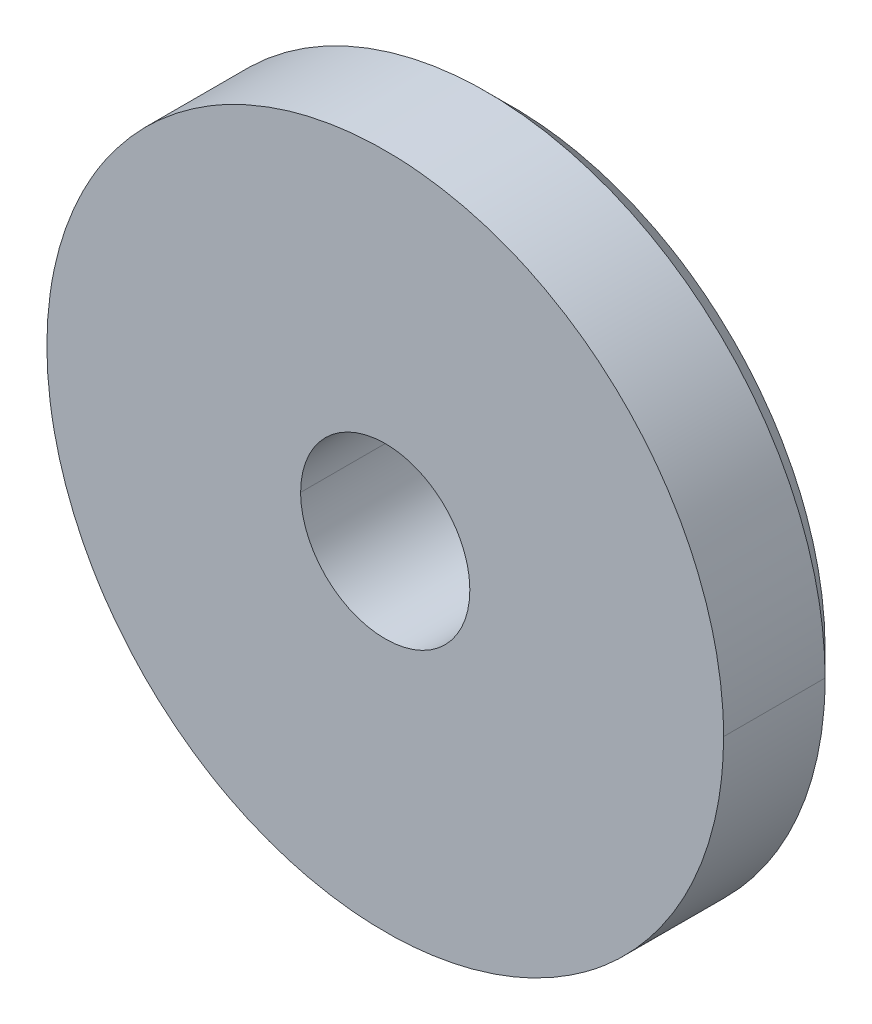
ISO-10303-21;
HEADER;
FILE_DESCRIPTION(('STEP AP214'),'2;1');
FILE_NAME('part.step','',(''),(''),'','','');
FILE_SCHEMA(('AUTOMOTIVE_DESIGN { 1 0 10303 214 1 1 1 1 }'));
ENDSEC;
DATA;
#1=APPLICATION_CONTEXT('core data for automotive mechanical design processes');
#2=APPLICATION_PROTOCOL_DEFINITION('international standard','automotive_design',2000,#1);
#3=PRODUCT_CONTEXT('',#1,'mechanical');
#4=PRODUCT('Part','Part','',(#3));
#5=PRODUCT_RELATED_PRODUCT_CATEGORY('part','',(#4));
#6=PRODUCT_DEFINITION_FORMATION('','',#4);
#7=PRODUCT_DEFINITION_CONTEXT('part definition',#1,'design');
#8=PRODUCT_DEFINITION('design','',#6,#7);
#9=PRODUCT_DEFINITION_SHAPE('','',#8);
#10=(LENGTH_UNIT() NAMED_UNIT(*) SI_UNIT(.MILLI.,.METRE.));
#11=(NAMED_UNIT(*) PLANE_ANGLE_UNIT() SI_UNIT($,.RADIAN.));
#12=(NAMED_UNIT(*) SI_UNIT($,.STERADIAN.) SOLID_ANGLE_UNIT());
#13=UNCERTAINTY_MEASURE_WITH_UNIT(LENGTH_MEASURE(1.E-05),#10,'distance_accuracy_value','');
#14=(GEOMETRIC_REPRESENTATION_CONTEXT(3) GLOBAL_UNCERTAINTY_ASSIGNED_CONTEXT((#13)) GLOBAL_UNIT_ASSIGNED_CONTEXT((#10,
#11,#12)) REPRESENTATION_CONTEXT('',''));
#15=CARTESIAN_POINT('',(0.,0.,0.));
#16=DIRECTION('',(0.,0.,1.));
#17=DIRECTION('',(1.,0.,0.));
#18=AXIS2_PLACEMENT_3D('',#15,#16,#17);
#19=CARTESIAN_POINT('',(0.976049460766,3.24671993963E-05,3.85545426228));
#20=CARTESIAN_POINT('',(0.97601299873,8.53633109443E-06,4.14825425885));
#21=CARTESIAN_POINT('',(0.976049457645,0.306651909166,3.85547932263));
#22=CARTESIAN_POINT('',(0.97601299561,0.306627978297,4.1482793192));
#23=CARTESIAN_POINT('',(0.855986811504,0.613557429072,3.8554894551));
#24=CARTESIAN_POINT('',(0.855950349468,0.613533498204,4.14828945167));
#25=CARTESIAN_POINT('',(0.613288340848,0.855969820392,3.85547904478));
#26=CARTESIAN_POINT('',(0.613251878812,0.855945889524,4.14827904135));
#27=CARTESIAN_POINT('',(4.94571779351E-05,1.09609510749,3.85542230458));
#28=CARTESIAN_POINT('',(1.29951425032E-05,1.09607117662,4.14822230115));
#29=CARTESIAN_POINT('',(-0.613189421604,0.855969820392,3.85532631296));
#30=CARTESIAN_POINT('',(-0.613225883639,0.855945889524,4.14812630953));
#31=CARTESIAN_POINT('',(-0.855887887326,0.613557429072,3.85527627738));
#32=CARTESIAN_POINT('',(-0.855924349361,0.613533498204,4.14807627395));
#33=CARTESIAN_POINT('',(-0.97595052722,0.306651909166,3.85523624239));
#34=CARTESIAN_POINT('',(-0.975986989255,0.306627978297,4.14803623896));
#35=CARTESIAN_POINT('',(-0.975950524099,3.24671993965E-05,3.85521118205));
#36=CARTESIAN_POINT('',(-0.975986986134,8.53633109443E-06,4.14801117862));
#37=B_SPLINE_SURFACE_WITH_KNOTS('',5,1,((#19,#20),(#21,#22),(#23,#24),(#25,#26),(#27,#28),(#29,
#30),(#31,#32),(#33,#34),(#35,#36)),.UNSPECIFIED.,.F.,.F.,.F.,(6,3,6),(2,2),(0.,6.28318530718,
12.5663706144),(0.300000000745,1.5),.UNSPECIFIED.);
#38=DIRECTION('',(-0.000124528808137852,-8.17311076397742E-05,0.999999988906301));
#39=VECTOR('',#38,1.);
#40=CARTESIAN_POINT('',(-0.9759687551165,2.0501765245465E-05,4.001611180335));
#41=LINE('',#40,#39);
#42=CARTESIAN_POINT('',(-0.975950524101392,3.24671994076295E-05,3.85521118190989));
#43=VERTEX_POINT('',#42);
#44=CARTESIAN_POINT('',(-0.975986986133999,8.53633109518673E-06,4.14801117861141));
#45=VERTEX_POINT('',#44);
#46=EDGE_CURVE('E75',#43,#45,#41,.T.);
#47=CARTESIAN_POINT('',(-0.975986986133999,8.53633109513173E-06,4.14801117861141));
#48=CARTESIAN_POINT('',(-0.976019665612717,0.0495793645592023,4.14801522602062));
#49=CARTESIAN_POINT('',(-0.972222562245067,0.0991368712350428,4.14801974925935));
#50=CARTESIAN_POINT('',(-0.957175118978073,0.197109302975169,4.14802963049502));
#51=CARTESIAN_POINT('',(-0.945924591985093,0.245524199326394,4.14803498851291));
#52=CARTESIAN_POINT('',(-0.914590142695726,0.345136374882293,4.14804703196816));
#53=CARTESIAN_POINT('',(-0.893692019144296,0.396079612973324,4.14805379803396));
#54=CARTESIAN_POINT('',(-0.843642589666615,0.493726562912701,4.14806801142337));
#55=CARTESIAN_POINT('',(-0.814491472814351,0.54043037185293,4.14807545873137));
#56=CARTESIAN_POINT('',(-0.748780520256903,0.628280971404677,4.14809082176505));
#57=CARTESIAN_POINT('',(-0.7122224447794,0.669429078437417,4.14809873737912));
#58=CARTESIAN_POINT('',(-0.632729152936538,0.745023029926607,4.14811481496169));
#59=CARTESIAN_POINT('',(-0.589793669897577,0.779468593974598,4.14812297694048));
#60=CARTESIAN_POINT('',(-0.498643974328852,0.840751593505803,4.14813933643117));
#61=CARTESIAN_POINT('',(-0.450416799032907,0.867569740696624,4.14814753398087));
#62=CARTESIAN_POINT('',(-0.35016093092327,0.912686027250866,4.14816370612904));
#63=CARTESIAN_POINT('',(-0.298135294254903,0.930990930629779,4.14817168089976));
#64=CARTESIAN_POINT('',(-0.204390506918451,0.955306974569725,4.14818534220389));
#65=CARTESIAN_POINT('',(-0.163149138109813,0.963203112432791,4.14819112330261));
#66=CARTESIAN_POINT('',(-0.0799972774095599,0.973631883846711,4.14820233046));
#67=CARTESIAN_POINT('',(-0.0380868790555828,0.976165260666451,4.14820775656777));
#68=CARTESIAN_POINT('',(0.0533628098058469,0.975807091191987,4.1482191154152));
#69=CARTESIAN_POINT('',(0.102901378345514,0.971843511249197,4.14822496044646));
#70=CARTESIAN_POINT('',(0.200823257052313,0.956434588356849,4.14823589515324));
#71=CARTESIAN_POINT('',(0.249205825522974,0.944984568955698,4.14824098435418));
#72=CARTESIAN_POINT('',(0.348691458110202,0.913253268081372,4.14825077974732));
#73=CARTESIAN_POINT('',(0.399539140265165,0.892164416533441,4.14825538813351));
#74=CARTESIAN_POINT('',(0.49697854873136,0.841747023963095,4.1482634014778));
#75=CARTESIAN_POINT('',(0.543569221615198,0.812416450746068,4.14826680613864));
#76=CARTESIAN_POINT('',(0.631175921764108,0.746362996796596,4.14827231707483));
#77=CARTESIAN_POINT('',(0.672192093613823,0.709640307853195,4.14827442338386));
#78=CARTESIAN_POINT('',(0.747492759530351,0.629842618355852,4.14827727853264));
#79=CARTESIAN_POINT('',(0.781777334399575,0.586767694061539,4.14827802738867));
#80=CARTESIAN_POINT('',(0.842701055133282,0.495385276179098,4.14827814536085));
#81=CARTESIAN_POINT('',(0.86932402774383,0.447067005780232,4.14827751158216));
#82=CARTESIAN_POINT('',(0.914050158275785,0.346638176173164,4.14827487311447));
#83=CARTESIAN_POINT('',(0.932155996321106,0.294528815891514,4.14827286885722));
#84=CARTESIAN_POINT('',(0.955794505363733,0.201889522377603,4.14826824102039));
#85=CARTESIAN_POINT('',(0.963371546064465,0.161868102855029,4.14826591358518));
#86=CARTESIAN_POINT('',(0.973483852526624,0.0812386429157237,4.14826058292381));
#87=CARTESIAN_POINT('',(0.97602471401665,0.0406313041273824,4.14825758045184));
#88=CARTESIAN_POINT('',(0.97601299873,8.5361493905759E-06,4.14825425884999));
#89=B_SPLINE_CURVE_WITH_KNOTS('',3,(#47,#48,#49,#50,#51,#52,#53,#54,#55,#56,#57,#58,#59,#60,#61,
#62,#63,#64,#65,#66,#67,#68,#69,#70,#71,#72,#73,#74,#75,#76,#77,#78,#79,#80,#81,#82,#83,#84,#85,
#86,#87,#88),.UNSPECIFIED.,.F.,.F.,(4,2,2,2,2,2,2,2,2,2,2,2,2,2,2,2,2,2,2,2,4),(0.,
0.148543455929664,0.297090640694499,0.461482360182372,0.625870313802274,0.79021924715013,
0.95457505474375,1.11934286479053,1.2839795375095,1.40961807688996,1.53523920185792,
1.68373884948418,1.83233134708682,1.99667717204644,2.1610635560334,2.32544567555183,
2.48982582179652,2.6545504627202,2.81922323429044,2.94111749072325,3.06287623363152),.UNSPECIFIED.);
#90=CARTESIAN_POINT('',(0.97601299873,8.53624019703715E-06,4.14825425884752));
#91=VERTEX_POINT('',#90);
#92=EDGE_CURVE('E23',#45,#91,#89,.T.);
#93=DIRECTION('',(0.000124528811552644,8.1731107639091E-05,-0.9999999889063));
#94=VECTOR('',#93,1.);
#95=CARTESIAN_POINT('',(0.976031229748,2.0501765245365E-05,4.001854260565));
#96=LINE('',#95,#94);
#97=CARTESIAN_POINT('',(0.976049460756775,3.24671994078454E-05,3.85545426214047));
#98=VERTEX_POINT('',#97);
#99=EDGE_CURVE('E65',#91,#98,#96,.T.);
#100=CARTESIAN_POINT('',(0.976049460766,3.24671994113E-05,3.8554542621));
#101=CARTESIAN_POINT('',(0.976049457645,0.306651909166,3.85547932245));
#102=CARTESIAN_POINT('',(0.855986811504,0.613557429072,3.85548945492));
#103=CARTESIAN_POINT('',(0.613288340848,0.855969820392,3.8554790446));
#104=CARTESIAN_POINT('',(4.94571779579E-05,1.09609510749,3.8554223044));
#105=CARTESIAN_POINT('',(-0.613189421604,0.855969820392,3.85532631278));
#106=CARTESIAN_POINT('',(-0.855887887326,0.613557429072,3.8552762772));
#107=CARTESIAN_POINT('',(-0.97595052722,0.306651909166,3.85523624221));
#108=CARTESIAN_POINT('',(-0.975950524099,3.24671994114E-05,3.85521118186));
#109=B_SPLINE_CURVE_WITH_KNOTS('',5,(#100,#101,#102,#103,#104,#105,#106,#107,#108),
.UNSPECIFIED.,.F.,.F.,(6,3,6),(0.,157.079632679,314.159265359),.UNSPECIFIED.);
#110=EDGE_CURVE('E74',#43,#98,#109,.F.);
#111=ORIENTED_EDGE('',*,*,#46,.T.);
#112=ORIENTED_EDGE('',*,*,#92,.T.);
#113=ORIENTED_EDGE('',*,*,#99,.T.);
#114=ORIENTED_EDGE('',*,*,#110,.F.);
#115=EDGE_LOOP('',(#111,#112,#113,#114));
#116=FACE_BOUND('',#115,.T.);
#117=ADVANCED_FACE('F16',(#116),#37,.T.);
#118=CARTESIAN_POINT('',(0.902858576842,3.84499164907E-05,3.7822451474));
#119=CARTESIAN_POINT('',(0.976049460766,3.24671994113E-05,3.8554542621));
#120=CARTESIAN_POINT('',(0.902858573956,0.283661433735,3.78226832822));
#121=CARTESIAN_POINT('',(0.976049457645,0.306651909166,3.85547932245));
#122=CARTESIAN_POINT('',(0.791800626275,0.567549039649,3.78227770076));
#123=CARTESIAN_POINT('',(0.855986811504,0.613557429072,3.85548945492));
#124=CARTESIAN_POINT('',(0.567304540918,0.79178050162,3.78226807121));
#125=CARTESIAN_POINT('',(0.613288340848,0.855969820392,3.8554790446));
#126=CARTESIAN_POINT('',(5.85735234913E-05,1.01389639218,3.78221558653));
#127=CARTESIAN_POINT('',(4.94571779579E-05,1.09609510749,3.8554223044));
#128=CARTESIAN_POINT('',(-0.56718738935,0.79178050162,3.78212679428));
#129=CARTESIAN_POINT('',(-0.613189421604,0.855969820392,3.85532631278));
#130=CARTESIAN_POINT('',(-0.791683470142,0.567549039649,3.78208051137));
#131=CARTESIAN_POINT('',(-0.855887887326,0.613557429072,3.8552762772));
#132=CARTESIAN_POINT('',(-0.902741412044,0.283661433735,3.78204347901));
#133=CARTESIAN_POINT('',(-0.97595052722,0.306651909166,3.85523624221));
#134=CARTESIAN_POINT('',(-0.902741409158,3.84499164907E-05,3.78202029818));
#135=CARTESIAN_POINT('',(-0.975950524099,3.24671994114E-05,3.85521118186));
#136=B_SPLINE_SURFACE_WITH_KNOTS('',5,1,((#118,#119),(#120,#121),(#122,#123),(#124,#125),(#126,
#127),(#128,#129),(#130,#131),(#132,#133),(#134,#135)),.UNSPECIFIED.,.F.,.F.,.F.,(6,3,6),(2,2),
(0.,157.079632679,314.159265359),(-0.212132034356,0.212132034356),.UNSPECIFIED.);
#137=DIRECTION('',(0.707018720524932,-5.77926204442466E-05,0.707194828521322));
#138=VECTOR('',#137,1.);
#139=CARTESIAN_POINT('',(0.939454018804,3.54585579508E-05,3.81884970475));
#140=LINE('',#139,#138);
#141=CARTESIAN_POINT('',(0.902858576841847,3.84499164904063E-05,3.78224514739992));
#142=VERTEX_POINT('',#141);
#143=EDGE_CURVE('E237',#142,#98,#140,.T.);
#144=CARTESIAN_POINT('',(0.902858576842,3.84499164906874E-05,3.78224514740015));
#145=CARTESIAN_POINT('',(0.90286863050016,0.0370905952116534,3.78224817696598));
#146=CARTESIAN_POINT('',(0.900583850556459,0.0741285714296735,3.78225091959933));
#147=CARTESIAN_POINT('',(0.891488724569767,0.14768768730635,3.78225579906052));
#148=CARTESIAN_POINT('',(0.884673215538957,0.184208188730611,3.78225793519324));
#149=CARTESIAN_POINT('',(0.863269651830208,0.269325419927434,3.78226222655825));
#150=CARTESIAN_POINT('',(0.84674967094521,0.317449104065496,3.78226410254838));
#151=CARTESIAN_POINT('',(0.805864602617299,0.410243067445227,3.78226659533413));
#152=CARTESIAN_POINT('',(0.781496796163969,0.454912143118321,3.7822672116928));
#153=CARTESIAN_POINT('',(0.725616191855309,0.539542428758479,3.78226716987432));
#154=CARTESIAN_POINT('',(0.694102616159167,0.579503125482643,3.78226651155838));
#155=CARTESIAN_POINT('',(0.624830346559063,0.653584786298256,3.78226393994136));
#156=CARTESIAN_POINT('',(0.587071506707105,0.687705613877616,3.78226202661095));
#157=CARTESIAN_POINT('',(0.506268534564779,0.749220681756895,3.78225699200757));
#158=CARTESIAN_POINT('',(0.463211154865413,0.77659752646651,3.78225386766315));
#159=CARTESIAN_POINT('',(0.373107936181577,0.823717750134644,3.78224649840459));
#160=CARTESIAN_POINT('',(0.326062411622011,0.843461730186202,3.78224225357872));
#161=CARTESIAN_POINT('',(0.229400589126129,0.8747157073813,3.7822327708191));
#162=CARTESIAN_POINT('',(0.179788838690346,0.886239768489403,3.7822275346011));
#163=CARTESIAN_POINT('',(0.0793323787826474,0.900790409860219,3.78221621411764));
#164=CARTESIAN_POINT('',(0.0284875779415925,0.903816358459563,3.78221012978918));
#165=CARTESIAN_POINT('',(-0.0729879847710562,0.9013106132677,3.78219728836067));
#166=CARTESIAN_POINT('',(-0.12361875959266,0.895779444891974,3.78219053130196));
#167=CARTESIAN_POINT('',(-0.223226674535677,0.876282051191716,3.78217653370315));
#168=CARTESIAN_POINT('',(-0.272203945879961,0.862316496893698,3.78216929320155));
#169=CARTESIAN_POINT('',(-0.367086452984281,0.826362447567604,3.78215453903145));
#170=CARTESIAN_POINT('',(-0.412993413194584,0.804378501644237,3.78214702552001));
#171=CARTESIAN_POINT('',(-0.500472864895845,0.753022233822015,3.7821319344032));
#172=CARTESIAN_POINT('',(-0.542045068403908,0.723649421479953,3.78212435679361));
#173=CARTESIAN_POINT('',(-0.619720282260602,0.658326386720376,3.78210934506754));
#174=CARTESIAN_POINT('',(-0.655818061803068,0.622369945147709,3.78210191109415));
#175=CARTESIAN_POINT('',(-0.72147473576176,0.544914058437219,3.78208740439112));
#176=CARTESIAN_POINT('',(-0.751033821837504,0.503414775826094,3.78208033165091));
#177=CARTESIAN_POINT('',(-0.802808064200271,0.415975800140174,3.78206673778166));
#178=CARTESIAN_POINT('',(-0.82501109429955,0.370028934881102,3.78206021757649));
#179=CARTESIAN_POINT('',(-0.861348919842518,0.275062307090688,3.7820479307425));
#180=CARTESIAN_POINT('',(-0.875489328501044,0.226044708862547,3.78204216359156));
#181=CARTESIAN_POINT('',(-0.891174530667952,0.147208425950166,3.78203376695524));
#182=CARTESIAN_POINT('',(-0.895513202240921,0.117917451831773,3.78203083268188));
#183=CARTESIAN_POINT('',(-0.901295232475644,0.0591012520361728,3.7820253055392));
#184=CARTESIAN_POINT('',(-0.902743492563976,0.0295765083028896,3.78202271209889));
#185=CARTESIAN_POINT('',(-0.902741409158,3.84499164907252E-05,3.78202029817969));
#186=B_SPLINE_CURVE_WITH_KNOTS('',3,(#144,#145,#146,#147,#148,#149,#150,#151,#152,#153,#154,
#155,#156,#157,#158,#159,#160,#161,#162,#163,#164,#165,#166,#167,#168,#169,#170,#171,#172,#173,
#174,#175,#176,#177,#178,#179,#180,#181,#182,#183,#184,#185),.UNSPECIFIED.,.F.,.F.,(4,2,2,2,2,2,
2,2,2,2,2,2,2,2,2,2,2,2,2,2,4),(0.,0.111058284074246,0.222243341947195,0.374128236228977,
0.526065810286498,0.678019931201982,0.829977603693962,0.982323228966974,1.13465685447813,
1.28672921373093,1.4388128761992,1.59088720095017,1.74294942849989,1.89492551985478,
2.04691170143374,2.19904220287271,2.35116824453335,2.50354382689183,2.65581319509513,
2.7445158256684,2.83306791016801),.UNSPECIFIED.);
#187=CARTESIAN_POINT('',(-0.902741409157654,3.84499164908437E-05,3.78202029818008));
#188=VERTEX_POINT('',#187);
#189=EDGE_CURVE('E153',#142,#188,#186,.T.);
#190=DIRECTION('',(0.707194830868391,5.77926204440462E-05,-0.707018718177277));
#191=VECTOR('',#190,1.);
#192=CARTESIAN_POINT('',(-0.939345966628,3.545855795145E-05,3.81861574002));
#193=LINE('',#192,#191);
#194=EDGE_CURVE('E235',#43,#188,#193,.T.);
#195=ORIENTED_EDGE('',*,*,#143,.F.);
#196=ORIENTED_EDGE('',*,*,#189,.T.);
#197=ORIENTED_EDGE('',*,*,#194,.F.);
#198=ORIENTED_EDGE('',*,*,#110,.T.);
#199=EDGE_LOOP('',(#195,#196,#197,#198));
#200=FACE_BOUND('',#199,.T.);
#201=ADVANCED_FACE('F162',(#200),#136,.T.);
#202=CARTESIAN_POINT('',(-0.902741409157,3.8449916491E-05,3.78202029818));
#203=CARTESIAN_POINT('',(-0.975950524099,3.24671994119E-05,3.85521118186));
#204=CARTESIAN_POINT('',(-0.902741406271,-0.283584533902,3.78199711736));
#205=CARTESIAN_POINT('',(-0.975950520978,-0.306586974767,3.85518612152));
#206=CARTESIAN_POINT('',(-0.79168345859,-0.567472139816,3.78198774483));
#207=CARTESIAN_POINT('',(-0.855887874837,-0.613492494674,3.85517598905));
#208=CARTESIAN_POINT('',(-0.567187373233,-0.791703601786,3.78199737437));
#209=CARTESIAN_POINT('',(-0.613189404181,-0.855904885993,3.85518639937));
#210=CARTESIAN_POINT('',(5.85941613329E-05,-1.01381949235,3.78204985906));
#211=CARTESIAN_POINT('',(4.94794891379E-05,-1.09603017309,3.85524313957));
#212=CARTESIAN_POINT('',(0.567304557034,-0.791703601786,3.78213865131));
#213=CARTESIAN_POINT('',(0.613288358271,-0.855904885993,3.85533913118));
#214=CARTESIAN_POINT('',(0.791800637827,-0.567472139816,3.78218493422));
#215=CARTESIAN_POINT('',(0.855986823993,-0.613492494674,3.85538916677));
#216=CARTESIAN_POINT('',(0.902858579729,-0.283584533902,3.78222196658));
#217=CARTESIAN_POINT('',(0.976049463887,-0.306586974767,3.85542920175));
#218=CARTESIAN_POINT('',(0.902858576842,3.84499164904E-05,3.7822451474));
#219=CARTESIAN_POINT('',(0.976049460766,3.24671994112E-05,3.8554542621));
#220=B_SPLINE_SURFACE_WITH_KNOTS('',5,1,((#202,#203),(#204,#205),(#206,#207),(#208,#209),(#210,
#211),(#212,#213),(#214,#215),(#216,#217),(#218,#219)),.UNSPECIFIED.,.F.,.F.,.F.,(6,3,6),(2,2),
(314.159265359,471.238898038,628.318530718),(-0.212132034358,0.212132034358),.UNSPECIFIED.);
#221=CARTESIAN_POINT('',(-0.902741409157,3.84499164910126E-05,3.78202029817985));
#222=CARTESIAN_POINT('',(-0.902751462814431,-0.0370136953779133,3.78201726861447));
#223=CARTESIAN_POINT('',(-0.900466682871218,-0.0740516715954581,3.78201452598095));
#224=CARTESIAN_POINT('',(-0.891371556886057,-0.147610787471198,3.7820096465192));
#225=CARTESIAN_POINT('',(-0.884556047856302,-0.184131288895,3.78200751038606));
#226=CARTESIAN_POINT('',(-0.86315248414819,-0.26924852009144,3.78200321902092));
#227=CARTESIAN_POINT('',(-0.846632503262009,-0.317372204229388,3.7820013430314));
#228=CARTESIAN_POINT('',(-0.805747434933276,-0.41016616760947,3.78199885024609));
#229=CARTESIAN_POINT('',(-0.781379628480294,-0.454835243283025,3.78199823388726));
#230=CARTESIAN_POINT('',(-0.725499024171876,-0.539465528923882,3.78199827570562));
#231=CARTESIAN_POINT('',(-0.693985448475642,-0.579426225648295,3.78199893402161));
#232=CARTESIAN_POINT('',(-0.624713178875413,-0.653507886464492,3.78200150563866));
#233=CARTESIAN_POINT('',(-0.586954339023419,-0.687628714044183,3.78200341896905));
#234=CARTESIAN_POINT('',(-0.506151366880872,-0.749143781924183,3.78200845357242));
#235=CARTESIAN_POINT('',(-0.463093987181313,-0.776520626634176,3.78201157791685));
#236=CARTESIAN_POINT('',(-0.372990768497,-0.823640850303029,3.78201894717542));
#237=CARTESIAN_POINT('',(-0.325945243937147,-0.843384830354924,3.78202319200128));
#238=CARTESIAN_POINT('',(-0.229283421440763,-0.874638807550466,3.7820326747609));
#239=CARTESIAN_POINT('',(-0.179671671004773,-0.886162868658705,3.7820379109789));
#240=CARTESIAN_POINT('',(-0.0792152110966512,-0.900713510029421,3.78204923146236));
#241=CARTESIAN_POINT('',(-0.0283704102553806,-0.903739458628538,3.78205531579082));
#242=CARTESIAN_POINT('',(0.0731051524556471,-0.901233713435733,3.78206815721932));
#243=CARTESIAN_POINT('',(0.123735927275422,-0.895702545059617,3.78207491427803));
#244=CARTESIAN_POINT('',(0.223343842214881,-0.876205151359299,3.78208891187685));
#245=CARTESIAN_POINT('',(0.272321113557433,-0.862239597061601,3.78209615237845));
#246=CARTESIAN_POINT('',(0.367203620660395,-0.826285547736364,3.78211090654855));
#247=CARTESIAN_POINT('',(0.41311058087096,-0.804301601813239,3.78211842005999));
#248=CARTESIAN_POINT('',(0.500590032572999,-0.752945333991789,3.7821335111768));
#249=CARTESIAN_POINT('',(0.542162236081578,-0.72357252165026,3.78214108878639));
#250=CARTESIAN_POINT('',(0.61983744994126,-0.658249486890427,3.78215610051244));
#251=CARTESIAN_POINT('',(0.655935229485957,-0.622293045316687,3.78216353448581));
#252=CARTESIAN_POINT('',(0.721591903448685,-0.54483715860354,3.78217804118892));
#253=CARTESIAN_POINT('',(0.751150989526241,-0.503337875990837,3.78218511392926));
#254=CARTESIAN_POINT('',(0.802925231890584,-0.415898900302694,3.78219870779818));
#255=CARTESIAN_POINT('',(0.825128261989889,-0.369952035043132,3.7822052280029));
#256=CARTESIAN_POINT('',(0.861466087533238,-0.274985407251814,3.7822175148381));
#257=CARTESIAN_POINT('',(0.875606496192129,-0.225967809023262,3.7822232819907));
#258=CARTESIAN_POINT('',(0.891291698356829,-0.147131526111387,3.78223167862635));
#259=CARTESIAN_POINT('',(0.89563036992841,-0.117840551994076,3.78223461289876));
#260=CARTESIAN_POINT('',(0.901412400160784,-0.0590243522007128,3.78224014004016));
#261=CARTESIAN_POINT('',(0.902860660248148,-0.0294996084685846,3.78224273348013));
#262=CARTESIAN_POINT('',(0.902858576842,3.84499164903749E-05,3.78224514740031));
#263=B_SPLINE_CURVE_WITH_KNOTS('',3,(#221,#222,#223,#224,#225,#226,#227,#228,#229,#230,#231,
#232,#233,#234,#235,#236,#237,#238,#239,#240,#241,#242,#243,#244,#245,#246,#247,#248,#249,#250,
#251,#252,#253,#254,#255,#256,#257,#258,#259,#260,#261,#262),.UNSPECIFIED.,.F.,.F.,(4,2,2,2,2,2,
2,2,2,2,2,2,2,2,2,2,2,2,2,2,4),(0.,0.111058284072565,0.222243341943533,0.374128236225998,
0.526065810284442,0.678019931200578,0.829977603693347,0.982323228967439,1.13465685447976,
1.28672921373323,1.43881287620201,1.59088720094769,1.74294942849229,1.89492551984763,
2.04691170142699,2.19904220287293,2.3511682445404,2.5035438269003,2.65581319510482,
2.74451582567424,2.83306791017018),.UNSPECIFIED.);
#264=EDGE_CURVE('E158',#188,#142,#263,.T.);
#265=CARTESIAN_POINT('',(-0.975950524099,3.24671994115E-05,3.85521118186));
#266=CARTESIAN_POINT('',(-0.975950520978,-0.306586974767,3.85518612152));
#267=CARTESIAN_POINT('',(-0.855887874837,-0.613492494674,3.85517598905));
#268=CARTESIAN_POINT('',(-0.613189404181,-0.855904885993,3.85518639937));
#269=CARTESIAN_POINT('',(4.94794891412E-05,-1.09603017309,3.85524313957));
#270=CARTESIAN_POINT('',(0.613288358271,-0.855904885993,3.85533913118));
#271=CARTESIAN_POINT('',(0.855986823993,-0.613492494674,3.85538916677));
#272=CARTESIAN_POINT('',(0.976049463887,-0.306586974767,3.85542920175));
#273=CARTESIAN_POINT('',(0.976049460766,3.24671994111E-05,3.8554542621));
#274=B_SPLINE_CURVE_WITH_KNOTS('',5,(#265,#266,#267,#268,#269,#270,#271,#272,#273),
.UNSPECIFIED.,.F.,.F.,(6,3,6),(12.5663706144,18.8495559215,25.1327412287),.UNSPECIFIED.);
#275=EDGE_CURVE('E152',#43,#98,#274,.T.);
#276=ORIENTED_EDGE('',*,*,#194,.T.);
#277=ORIENTED_EDGE('',*,*,#264,.T.);
#278=ORIENTED_EDGE('',*,*,#143,.T.);
#279=ORIENTED_EDGE('',*,*,#275,.F.);
#280=EDGE_LOOP('',(#276,#277,#278,#279));
#281=FACE_BOUND('',#280,.T.);
#282=ADVANCED_FACE('F125',(#281),#220,.T.);
#283=CARTESIAN_POINT('',(5.85838424126E-05,3.84499164906E-05,3.78213272279));
#284=DIRECTION('',(-0.000124528809611037,-8.17311076401246E-05,0.999999988906301));
#285=DIRECTION('',(0.999999992246288,0.,0.000124528810026962));
#286=AXIS2_PLACEMENT_3D('',#283,#284,#285);
#287=PLANE('',#286);
#288=CARTESIAN_POINT('',(-0.243941414266,3.84499164906145E-05,3.78210233775982));
#289=CARTESIAN_POINT('',(-0.243953434449117,-0.0136805998741809,3.78210121499015));
#290=CARTESIAN_POINT('',(-0.242787955785832,-0.0273958590447934,3.78210023916263));
#291=CARTESIAN_POINT('',(-0.238182131138082,-0.0544273697025755,3.78209860340527));
#292=CARTESIAN_POINT('',(-0.234743707180429,-0.0677439483818637,3.78209794320934));
#293=CARTESIAN_POINT('',(-0.225669499099059,-0.0936179069665731,3.78209695850234));
#294=CARTESIAN_POINT('',(-0.220032563958268,-0.106174885203539,3.78209663416742));
#295=CARTESIAN_POINT('',(-0.206747041189865,-0.130155219309278,3.78209632865851));
#296=CARTESIAN_POINT('',(-0.199098764331948,-0.141578749930291,3.78209634743152));
#297=CARTESIAN_POINT('',(-0.173420995358586,-0.173661495166728,3.78209692289516));
#298=CARTESIAN_POINT('',(-0.152628372362356,-0.192216846379674,3.78209799562615));
#299=CARTESIAN_POINT('',(-0.106071235870219,-0.221386948917574,3.78210140922669));
#300=CARTESIAN_POINT('',(-0.080298025295365,-0.231987649399349,3.78210375232765));
#301=CARTESIAN_POINT('',(-0.0267526834854187,-0.244032427797408,3.78210943583042));
#302=CARTESIAN_POINT('',(0.00101429315272359,-0.24549931481173,3.78211277372611));
#303=CARTESIAN_POINT('',(0.0555103522239511,-0.239158175297444,3.78212007832221));
#304=CARTESIAN_POINT('',(0.0822378870168942,-0.231336827251303,3.78212404591867));
#305=CARTESIAN_POINT('',(0.131539385055629,-0.207315621273826,3.78213214865787));
#306=CARTESIAN_POINT('',(0.15412078858929,-0.191130974554591,3.78213628348391));
#307=CARTESIAN_POINT('',(0.192736283168432,-0.152115379245067,3.78214428101396));
#308=CARTESIAN_POINT('',(0.208755322502512,-0.129269354844517,3.78214814307576));
#309=CARTESIAN_POINT('',(0.226421278617509,-0.0920980307470904,3.7821533810509));
#310=CARTESIAN_POINT('',(0.231252919302829,-0.0791935808651548,3.78215503742517));
#311=CARTESIAN_POINT('',(0.238674990816741,-0.0527595073409256,3.7821581221707));
#312=CARTESIAN_POINT('',(0.241268801445729,-0.0392308591002468,3.78215955088312));
#313=CARTESIAN_POINT('',(0.243611984988157,-0.0170737069467953,3.78216165360562));
#314=CARTESIAN_POINT('',(0.244063995040805,-0.00851437973974919,3.78216240945845));
#315=CARTESIAN_POINT('',(0.244058581951,3.84499164904711E-05,3.78216310782035));
#316=B_SPLINE_CURVE_WITH_KNOTS('',3,(#288,#289,#290,#291,#292,#293,#294,#295,#296,#297,#298,
#299,#300,#301,#302,#303,#304,#305,#306,#307,#308,#309,#310,#311,#312,#313,#314,#315),
.UNSPECIFIED.,.F.,.F.,(4,2,2,2,2,2,2,2,2,2,2,2,2,4),(0.,0.0411014434350411,0.0821681754345153,
0.123256436593653,0.164338352987133,0.246247380886622,0.328300751915893,0.410149135568275,
0.492115051001766,0.573932408394778,0.655936388737336,0.697112382827344,0.738226079296645,
0.763888788667658),.UNSPECIFIED.);
#317=CARTESIAN_POINT('',(-0.243941414266,3.84499164906428E-05,3.78210233776009));
#318=VERTEX_POINT('',#317);
#319=CARTESIAN_POINT('',(0.244058581951,3.84499164905356E-05,3.78216310782018));
#320=VERTEX_POINT('',#319);
#321=EDGE_CURVE('E114',#318,#320,#316,.T.);
#322=ORIENTED_EDGE('',*,*,#321,.T.);
#323=CARTESIAN_POINT('',(0.244058581951,3.84499164905856E-05,3.78216310782018));
#324=CARTESIAN_POINT('',(0.244071728094655,0.0137567361173647,3.78216423066765));
#325=CARTESIAN_POINT('',(0.242905700806418,0.0274722486648608,3.78216520644757));
#326=CARTESIAN_POINT('',(0.238298779446531,0.0545044413007847,3.78216684212409));
#327=CARTESIAN_POINT('',(0.234859779046536,0.0678214437525683,3.78216750228287));
#328=CARTESIAN_POINT('',(0.225787680896176,0.0936944456101512,3.78216848717442));
#329=CARTESIAN_POINT('',(0.220153394095547,0.10625002833587,3.78216881172507));
#330=CARTESIAN_POINT('',(0.206859896790212,0.130235048770541,3.78216911662396));
#331=CARTESIAN_POINT('',(0.199201097886578,0.141664714740614,3.78216909704212));
#332=CARTESIAN_POINT('',(0.182072880465822,0.16308428004158,3.78216871473038));
#333=CARTESIAN_POINT('',(0.172602637133113,0.173073519846686,3.78216835184388));
#334=CARTESIAN_POINT('',(0.152122742353557,0.191324496891383,3.78216729317952));
#335=CARTESIAN_POINT('',(0.141113060140236,0.199586199597026,3.78216659739501));
#336=CARTESIAN_POINT('',(0.117834161932205,0.214163065829941,3.78216488988493));
#337=CARTESIAN_POINT('',(0.1055620065758,0.220473543158801,3.78216387741032));
#338=CARTESIAN_POINT('',(0.0801510830515565,0.230931318557557,3.78216156774381));
#339=CARTESIAN_POINT('',(0.0670133685885127,0.235081193999833,3.78216027089377));
#340=CARTESIAN_POINT('',(0.0360578685082309,0.242039951167835,3.78215698478908));
#341=CARTESIAN_POINT('',(0.0180496022615604,0.244036802931723,3.78215490544601));
#342=CARTESIAN_POINT('',(-0.0136529931366819,0.244039703704363,3.78215095779658));
#343=CARTESIAN_POINT('',(-0.0273545516692008,0.242882044990244,3.78214915694106));
#344=CARTESIAN_POINT('',(-0.0543781537211301,0.238290075339778,3.78214541641725));
#345=CARTESIAN_POINT('',(-0.0676997935491953,0.23485343041494,3.78214347660847));
#346=CARTESIAN_POINT('',(-0.106468587808301,0.221240447860893,3.78213753617252));
#347=CARTESIAN_POINT('',(-0.130836195829151,0.207760206562372,3.78213339994838));
#348=CARTESIAN_POINT('',(-0.173725450155456,0.173465815772746,3.78212525608153));
#349=CARTESIAN_POINT('',(-0.192244036210102,0.152647839137633,3.78212124850712));
#350=CARTESIAN_POINT('',(-0.214083099284536,0.117798777041148,3.7821156806633));
#351=CARTESIAN_POINT('',(-0.220381850216002,0.10554085402772,3.78211389443446));
#352=CARTESIAN_POINT('',(-0.230832776355746,0.0801300446009904,3.7821105161371));
#353=CARTESIAN_POINT('',(-0.234986060232404,0.0669776244029049,3.78210892396863));
#354=CARTESIAN_POINT('',(-0.239976632848971,0.0447933445101313,3.78210648935377));
#355=CARTESIAN_POINT('',(-0.241463200136577,0.0359010542726193,3.78210557745856));
#356=CARTESIAN_POINT('',(-0.243445313553273,0.0180200239276603,3.78210386919442));
#357=CARTESIAN_POINT('',(-0.243942326036209,0.00903144640447489,3.78210307265617));
#358=CARTESIAN_POINT('',(-0.243941414266,3.84499164907289E-05,3.78210233775965));
#359=B_SPLINE_CURVE_WITH_KNOTS('',3,(#323,#324,#325,#326,#327,#328,#329,#330,#331,#332,#333,
#334,#335,#336,#337,#338,#339,#340,#341,#342,#343,#344,#345,#346,#347,#348,#349,#350,#351,#352,
#353,#354,#355,#356,#357,#358),.UNSPECIFIED.,.F.,.F.,(4,2,2,2,2,2,2,2,2,2,2,2,2,2,2,2,2,4),(0.,
0.0411011873932817,0.0821681754334133,0.12325743790051,0.164338352976624,0.205438018387513,
0.246538505313664,0.287736948771565,0.328886133532547,0.382765462612746,0.423828760810554,
0.464934178431976,0.546812465179672,0.628733520548647,0.669916141237457,0.71107745949787,
0.738073961917008,0.765030430196088),.UNSPECIFIED.);
#360=EDGE_CURVE('E146',#320,#318,#359,.T.);
#361=ORIENTED_EDGE('',*,*,#360,.T.);
#362=EDGE_LOOP('',(#322,#361));
#363=FACE_BOUND('',#362,.T.);
#364=ORIENTED_EDGE('',*,*,#264,.F.);
#365=ORIENTED_EDGE('',*,*,#189,.F.);
#366=EDGE_LOOP('',(#364,#365));
#367=FACE_BOUND('',#366,.T.);
#368=ADVANCED_FACE('F104',(#363,#367),#287,.F.);
#369=CARTESIAN_POINT('',(-0.975950524099,3.24671994115E-05,3.85521118186));
#370=CARTESIAN_POINT('',(-0.975986986134,8.53633109454E-06,4.14801117862));
#371=CARTESIAN_POINT('',(-0.975950520978,-0.306586974767,3.85518612152));
#372=CARTESIAN_POINT('',(-0.975986983014,-0.306610905635,4.14798611827));
#373=CARTESIAN_POINT('',(-0.855887874837,-0.613492494674,3.85517598905));
#374=CARTESIAN_POINT('',(-0.855924336872,-0.613516425542,4.1479759858));
#375=CARTESIAN_POINT('',(-0.613189404181,-0.855904885993,3.85518639937));
#376=CARTESIAN_POINT('',(-0.613225866216,-0.855928816861,4.14798639612));
#377=CARTESIAN_POINT('',(4.94794891412E-05,-1.09603017309,3.85524313957));
#378=CARTESIAN_POINT('',(1.30174536863E-05,-1.09605410396,4.14804313632));
#379=CARTESIAN_POINT('',(0.613288358271,-0.855904885993,3.85533913118));
#380=CARTESIAN_POINT('',(0.613251896236,-0.855928816861,4.14813912794));
#381=CARTESIAN_POINT('',(0.855986823993,-0.613492494674,3.85538916677));
#382=CARTESIAN_POINT('',(0.855950361957,-0.613516425542,4.14818916352));
#383=CARTESIAN_POINT('',(0.976049463887,-0.306586974767,3.85542920175));
#384=CARTESIAN_POINT('',(0.976013001851,-0.306610905635,4.14822919851));
#385=CARTESIAN_POINT('',(0.976049460766,3.24671994111E-05,3.8554542621));
#386=CARTESIAN_POINT('',(0.97601299873,8.5363310941E-06,4.14825425885));
#387=B_SPLINE_SURFACE_WITH_KNOTS('',5,1,((#369,#370),(#371,#372),(#373,#374),(#375,#376),(#377,
#378),(#379,#380),(#381,#382),(#383,#384),(#385,#386)),.UNSPECIFIED.,.F.,.F.,.F.,(6,3,6),(2,2),
(12.5663706144,18.8495559215,25.1327412287),(0.3,1.5),.UNSPECIFIED.);
#388=CARTESIAN_POINT('',(-0.975986986133999,8.53633109524173E-06,4.14801117861141));
#389=CARTESIAN_POINT('',(-0.976019660488125,-0.0495625081759819,4.14800712304609));
#390=CARTESIAN_POINT('',(-0.972222524991561,-0.0991202310615606,4.14800354549123));
#391=CARTESIAN_POINT('',(-0.957175019048539,-0.197092653229047,4.14799741194459));
#392=CARTESIAN_POINT('',(-0.945924526371992,-0.245507333752338,4.14799485596956));
#393=CARTESIAN_POINT('',(-0.91459038371998,-0.345118497745502,4.14799061664223));
#394=CARTESIAN_POINT('',(-0.893692635812285,-0.396060972574134,4.14798905542899));
#395=CARTESIAN_POINT('',(-0.843643496896576,-0.493708049491014,4.1479873071849));
#396=CARTESIAN_POINT('',(-0.81449204153534,-0.540412618533043,4.14798712016478));
#397=CARTESIAN_POINT('',(-0.748779854189154,-0.628264677763678,4.14798812297915));
#398=CARTESIAN_POINT('',(-0.712220865969963,-0.669413472014231,4.14798931248991));
#399=CARTESIAN_POINT('',(-0.63272789640769,-0.745007159913005,4.14799303329898));
#400=CARTESIAN_POINT('',(-0.589793872677632,-0.779452008983844,4.14799556460621));
#401=CARTESIAN_POINT('',(-0.498659195988743,-0.840723639255947,4.14800190570087));
#402=CARTESIAN_POINT('',(-0.450447331028813,-0.867533749087587,4.14800571824709));
#403=CARTESIAN_POINT('',(-0.350202087304431,-0.912655589128227,4.1480145138101));
#404=CARTESIAN_POINT('',(-0.298169026977317,-0.930968026557632,4.14801949672942));
#405=CARTESIAN_POINT('',(-0.191885053394345,-0.958530714346252,4.14803047941725));
#406=CARTESIAN_POINT('',(-0.13763953734166,-0.96780178716157,4.14803647681181));
#407=CARTESIAN_POINT('',(-0.0283599514730378,-0.977121494857423,4.14804932355866));
#408=CARTESIAN_POINT('',(0.0266741669087274,-0.977169559279501,4.14805617296363));
#409=CARTESIAN_POINT('',(0.136029559638037,-0.968036166449024,4.14807053734298));
#410=CARTESIAN_POINT('',(0.190350045397541,-0.95884524773841,4.14807805299246));
#411=CARTESIAN_POINT('',(0.296666607415292,-0.931452247984042,4.14809353132776));
#412=CARTESIAN_POINT('',(0.348662825658802,-0.913250718204538,4.1481014939862));
#413=CARTESIAN_POINT('',(0.448776735423533,-0.86840327073388,4.14811762648394));
#414=CARTESIAN_POINT('',(0.496900338285263,-0.841770541708676,4.14812579598145));
#415=CARTESIAN_POINT('',(0.588007581545415,-0.780817488551308,4.14814212321873));
#416=CARTESIAN_POINT('',(0.630991058197025,-0.746496919610915,4.14815028095812));
#417=CARTESIAN_POINT('',(0.710683392341194,-0.671079495638577,4.1481663688994));
#418=CARTESIAN_POINT('',(0.747379822529934,-0.629969528121472,4.14817429862544));
#419=CARTESIAN_POINT('',(0.81336336259308,-0.542150178408898,4.14818969305002));
#420=CARTESIAN_POINT('',(0.842650803611041,-0.495441046604734,4.14819715776935));
#421=CARTESIAN_POINT('',(0.880383306407375,-0.422199476735546,4.14820784266777));
#422=CARTESIAN_POINT('',(0.891937581425099,-0.397224859330456,4.14821132271106));
#423=CARTESIAN_POINT('',(0.912888339159409,-0.346414097654271,4.14821808450388));
#424=CARTESIAN_POINT('',(0.922286613760375,-0.320578689403927,4.14822136641638));
#425=CARTESIAN_POINT('',(0.947132397081092,-0.242047538471485,4.14823087887033));
#426=CARTESIAN_POINT('',(0.959273319875981,-0.188244323112008,4.14823678816165));
#427=CARTESIAN_POINT('',(0.969873146656306,-0.111683866782654,4.14824436551608));
#428=CARTESIAN_POINT('',(0.972177198655963,-0.0893869030802669,4.14824647479231));
#429=CARTESIAN_POINT('',(0.975244839409149,-0.0447281662208998,4.14825050681061));
#430=CARTESIAN_POINT('',(0.976011239987254,-0.0223665863826303,4.14825242988703));
#431=CARTESIAN_POINT('',(0.97601299873,8.53614929912524E-06,4.14825425885139));
#432=B_SPLINE_CURVE_WITH_KNOTS('',3,(#388,#389,#390,#391,#392,#393,#394,#395,#396,#397,#398,
#399,#400,#401,#402,#403,#404,#405,#406,#407,#408,#409,#410,#411,#412,#413,#414,#415,#416,#417,
#418,#419,#420,#421,#422,#423,#424,#425,#426,#427,#428,#429,#430,#431),.UNSPECIFIED.,.F.,.F.,(4,
2,2,2,2,2,2,2,2,2,2,2,2,2,2,2,2,2,2,2,2,4),(0.,0.148544102407165,0.297090640898874,
0.461479836582212,0.62587031402477,0.7902221380935,0.954575054970043,1.11928415143415,
1.28397953749271,1.44829472448401,1.61262007464048,1.77711387871724,1.94159762039664,
2.10582532611577,2.2700582621741,2.43461217521103,2.59915873223789,2.68162537970039,
2.7640232375523,2.92854385244896,2.99575194109686,3.06283701732068),.UNSPECIFIED.);
#433=EDGE_CURVE('E71',#45,#91,#432,.T.);
#434=ORIENTED_EDGE('',*,*,#99,.F.);
#435=ORIENTED_EDGE('',*,*,#433,.F.);
#436=ORIENTED_EDGE('',*,*,#46,.F.);
#437=ORIENTED_EDGE('',*,*,#275,.T.);
#438=EDGE_LOOP('',(#434,#435,#436,#437));
#439=FACE_BOUND('',#438,.T.);
#440=ADVANCED_FACE('F77',(#439),#387,.T.);
#441=CARTESIAN_POINT('',(0.244058581951,3.84499164906E-05,3.78216310782));
#442=CARTESIAN_POINT('',(0.244013004406,8.53633109432E-06,4.14816310376));
#443=CARTESIAN_POINT('',(0.24405858117,0.0766933104081,3.78216937291));
#444=CARTESIAN_POINT('',(0.244013003626,0.0766633968227,4.14816936885));
#445=CARTESIAN_POINT('',(0.214042919635,0.153419690385,3.78217190603));
#446=CARTESIAN_POINT('',(0.213997342091,0.153389776799,4.14817190197));
#447=CARTESIAN_POINT('',(0.153368301971,0.214022788215,3.78216930345));
#448=CARTESIAN_POINT('',(0.153322724427,0.213992874629,4.14816929939));
#449=CARTESIAN_POINT('',(5.85810535148E-05,0.274054109988,3.7821551184));
#450=CARTESIAN_POINT('',(1.30035091972E-05,0.274024196403,4.14815511434));
#451=CARTESIAN_POINT('',(-0.153251138642,0.214022788215,3.78213112049));
#452=CARTESIAN_POINT('',(-0.153296716186,0.213992874629,4.14813111643));
#453=CARTESIAN_POINT('',(-0.213925755072,0.153419690385,3.7821186116));
#454=CARTESIAN_POINT('',(-0.213971332617,0.153389776799,4.14811860754));
#455=CARTESIAN_POINT('',(-0.243941415046,0.0766933104081,3.78210860285));
#456=CARTESIAN_POINT('',(-0.24398699259,0.0766633968227,4.14810859879));
#457=CARTESIAN_POINT('',(-0.243941414266,3.84499164907E-05,3.78210233776));
#458=CARTESIAN_POINT('',(-0.24398699181,8.53633109438E-06,4.1481023337));
#459=B_SPLINE_SURFACE_WITH_KNOTS('',5,1,((#441,#442),(#443,#444),(#445,#446),(#447,#448),(#449,
#450),(#451,#452),(#453,#454),(#455,#456),(#457,#458)),.UNSPECIFIED.,.F.,.F.,.F.,(6,3,6),(2,2),
(0.,1.57079632679,3.14159265359),(0.,1.5),.UNSPECIFIED.);
#460=DIRECTION('',(-0.000124528811475313,-8.17311076399889E-05,0.9999999889063));
#461=VECTOR('',#460,1.);
#462=CARTESIAN_POINT('',(0.2440357931785,2.349312379237E-05,3.96516310579));
#463=LINE('',#462,#461);
#464=CARTESIAN_POINT('',(0.244013004406,8.53633109424724E-06,4.14816310375991));
#465=VERTEX_POINT('',#464);
#466=EDGE_CURVE('E79',#320,#465,#463,.T.);
#467=CARTESIAN_POINT('',(-0.24398699181,8.53633109439447E-06,4.14810233369982));
#468=CARTESIAN_POINT('',(-0.244000138233019,0.0137268225316946,4.14810345327379));
#469=CARTESIAN_POINT('',(-0.242834111224108,0.0274423350789275,4.14810471946194));
#470=CARTESIAN_POINT('',(-0.238227190414795,0.0544745277143102,4.14810750252748));
#471=CARTESIAN_POINT('',(-0.234788190286061,0.067791530165817,4.14810901919541));
#472=CARTESIAN_POINT('',(-0.225716092662778,0.0936645320228623,4.14811226356203));
#473=CARTESIAN_POINT('',(-0.220081806117959,0.106220114748321,4.14811399137475));
#474=CARTESIAN_POINT('',(-0.206788309301354,0.130205135182588,4.14811760712041));
#475=CARTESIAN_POINT('',(-0.199129510630634,0.141634801152511,4.14811949502077));
#476=CARTESIAN_POINT('',(-0.182001293646402,0.16305436645328,4.14812337862208));
#477=CARTESIAN_POINT('',(-0.172531050517285,0.173043606258334,4.14812537437184));
#478=CARTESIAN_POINT('',(-0.152051156109833,0.191294583303062,4.14812941638133));
#479=CARTESIAN_POINT('',(-0.141041474065019,0.19955628600878,4.14813146264207));
#480=CARTESIAN_POINT('',(-0.117762576154372,0.214133152241733,4.14813555291898));
#481=CARTESIAN_POINT('',(-0.10549042092678,0.220443629570605,4.14813759691819));
#482=CARTESIAN_POINT('',(-0.0800794976161741,0.230901404970178,4.14814161603583));
#483=CARTESIAN_POINT('',(-0.0669417832379265,0.235051280413066,4.1481435912337));
#484=CARTESIAN_POINT('',(-0.0359862825384428,0.242010037751785,4.14814801483235));
#485=CARTESIAN_POINT('',(-0.0179780155302395,0.244006889517588,4.14815042058533));
#486=CARTESIAN_POINT('',(0.0137245806470398,0.244009789988205,4.148154368709));
#487=CARTESIAN_POINT('',(0.0274261391910549,0.242852131142813,4.14815598033105));
#488=CARTESIAN_POINT('',(0.0544497412903375,0.238260161233562,4.1481589702413));
#489=CARTESIAN_POINT('',(0.0677713811543212,0.23482351618142,4.14816034828846));
#490=CARTESIAN_POINT('',(0.106540175557709,0.221210533257542,4.14816406351615));
#491=CARTESIAN_POINT('',(0.130907783722434,0.207730291727463,4.14816599623034));
#492=CARTESIAN_POINT('',(0.173797038420892,0.173435900528943,4.14816853425962));
#493=CARTESIAN_POINT('',(0.192315624702946,0.152617923715385,4.14816913888083));
#494=CARTESIAN_POINT('',(0.214154688154958,0.117768861408099,4.14816901022093));
#495=CARTESIAN_POINT('',(0.220453439218618,0.105510938334441,4.14816879274327));
#496=CARTESIAN_POINT('',(0.230904365631878,0.0801001288081789,4.14816801733109));
#497=CARTESIAN_POINT('',(0.235057649649997,0.0669477085708419,4.14816745957274));
#498=CARTESIAN_POINT('',(0.240048222420336,0.0447634290105353,4.14816626789704));
#499=CARTESIAN_POINT('',(0.241534789760853,0.0358711391471169,4.14816572624077));
#500=CARTESIAN_POINT('',(0.24351690337019,0.0179901095648987,4.14816451163472));
#501=CARTESIAN_POINT('',(0.244013915992828,0.00900153243035066,4.14816383888084));
#502=CARTESIAN_POINT('',(0.244013004406,8.53633109432E-06,4.14816310376));
#503=B_SPLINE_CURVE_WITH_KNOTS('',3,(#467,#468,#469,#470,#471,#472,#473,#474,#475,#476,#477,
#478,#479,#480,#481,#482,#483,#484,#485,#486,#487,#488,#489,#490,#491,#492,#493,#494,#495,#496,
#497,#498,#499,#500,#501,#502),.UNSPECIFIED.,.F.,.F.,(4,2,2,2,2,2,2,2,2,2,2,2,2,2,2,2,2,4),(0.,
0.041101187392462,0.0821681754316559,0.123257437897762,0.164338352973091,0.205438018383325,
0.246538505308971,0.28773694876533,0.328886133528493,0.382765464933592,0.42382876313103,
0.464934180748407,0.54681246749094,0.628733522867495,0.669916143556323,0.71107746181402,
0.738073963069963,0.765030430184803),.UNSPECIFIED.);
#504=CARTESIAN_POINT('',(-0.24398699181,8.53633109437277E-06,4.14810233370009));
#505=VERTEX_POINT('',#504);
#506=EDGE_CURVE('E34',#505,#465,#503,.T.);
#507=DIRECTION('',(0.000124528808743109,8.17311076398798E-05,-0.999999988906301));
#508=VECTOR('',#507,1.);
#509=CARTESIAN_POINT('',(-0.243964203038,2.349312379249E-05,3.96510233573));
#510=LINE('',#509,#508);
#511=EDGE_CURVE('E151',#505,#318,#510,.T.);
#512=ORIENTED_EDGE('',*,*,#360,.F.);
#513=ORIENTED_EDGE('',*,*,#466,.T.);
#514=ORIENTED_EDGE('',*,*,#506,.F.);
#515=ORIENTED_EDGE('',*,*,#511,.T.);
#516=EDGE_LOOP('',(#512,#513,#514,#515));
#517=FACE_BOUND('',#516,.T.);
#518=ADVANCED_FACE('F124',(#517),#459,.F.);
#519=CARTESIAN_POINT('',(-0.243941414266,3.84499164906E-05,3.78210233776));
#520=CARTESIAN_POINT('',(-0.24398699181,8.53633109438E-06,4.1481023337));
#521=CARTESIAN_POINT('',(-0.243941413485,-0.0766164105751,3.78209607268));
#522=CARTESIAN_POINT('',(-0.24398699103,-0.0766463241605,4.14809606862));
#523=CARTESIAN_POINT('',(-0.21392575195,-0.153342790552,3.78209353956));
#524=CARTESIAN_POINT('',(-0.213971329494,-0.153372704137,4.1480935355));
#525=CARTESIAN_POINT('',(-0.153251134286,-0.213945888382,3.78209614214));
#526=CARTESIAN_POINT('',(-0.15329671183,-0.213975801967,4.14809613808));
#527=CARTESIAN_POINT('',(5.85866313102E-05,-0.273977210155,3.78211032719));
#528=CARTESIAN_POINT('',(1.30090869926E-05,-0.274007123741,4.14811032313));
#529=CARTESIAN_POINT('',(0.153368306327,-0.213945888382,3.78213432509));
#530=CARTESIAN_POINT('',(0.153322728782,-0.213975801967,4.14813432103));
#531=CARTESIAN_POINT('',(0.214042922757,-0.153342790552,3.78214683399));
#532=CARTESIAN_POINT('',(0.213997345213,-0.153372704137,4.14814682993));
#533=CARTESIAN_POINT('',(0.244058582731,-0.0766164105751,3.78215684274));
#534=CARTESIAN_POINT('',(0.244013005186,-0.0766463241605,4.14815683868));
#535=CARTESIAN_POINT('',(0.244058581951,3.84499164905E-05,3.78216310782));
#536=CARTESIAN_POINT('',(0.244013004406,8.53633109424E-06,4.14816310376));
#537=B_SPLINE_SURFACE_WITH_KNOTS('',5,1,((#519,#520),(#521,#522),(#523,#524),(#525,#526),(#527,
#528),(#529,#530),(#531,#532),(#533,#534),(#535,#536)),.UNSPECIFIED.,.F.,.F.,.F.,(6,3,6),(2,2),
(3.14159265359,4.71238898038,6.28318530718),(0.,1.5),.UNSPECIFIED.);
#538=CARTESIAN_POINT('',(0.244013004406,8.53633109422556E-06,4.14816310376018));
#539=CARTESIAN_POINT('',(0.244025024868496,-0.0137105134593137,4.14816198398359));
#540=CARTESIAN_POINT('',(0.242859546484532,-0.027425772629673,4.14816071788448));
#541=CARTESIAN_POINT('',(0.238253722387337,-0.0544572832869652,4.14815793501124));
#542=CARTESIAN_POINT('',(0.234815298700926,-0.067773861966017,4.14815641844972));
#543=CARTESIAN_POINT('',(0.22574109114662,-0.0936478205502834,4.14815317374217));
#544=CARTESIAN_POINT('',(0.220104156261643,-0.106204798787042,4.14815144548563));
#545=CARTESIAN_POINT('',(0.206818633981837,-0.130185132892417,4.14814783111598));
#546=CARTESIAN_POINT('',(0.199170357356705,-0.141608663513272,4.14814594502729));
#547=CARTESIAN_POINT('',(0.173492589037132,-0.1736914087495,4.14814012524732));
#548=CARTESIAN_POINT('',(0.152699966419119,-0.19224675996246,4.14813601941827));
#549=CARTESIAN_POINT('',(0.106142830521374,-0.221416862501105,4.14812783760972));
#550=CARTESIAN_POINT('',(0.0803696201623096,-0.232017562983453,4.14812376169558));
#551=CARTESIAN_POINT('',(0.0268242785972864,-0.244062341382531,4.14811610932386));
#552=CARTESIAN_POINT('',(-0.000942698011260129,-0.245529228397288,4.14811253164396));
#553=CARTESIAN_POINT('',(-0.0554387572114591,-0.239188088883553,4.1481062635821));
#554=CARTESIAN_POINT('',(-0.0821662921632668,-0.231366740837754,4.14810357448166));
#555=CARTESIAN_POINT('',(-0.131467790690673,-0.207345534861142,4.1480993983047));
#556=CARTESIAN_POINT('',(-0.154049194553802,-0.191160888142375,4.14809790905842));
#557=CARTESIAN_POINT('',(-0.19266468992781,-0.152145292833524,4.14809628910436));
#558=CARTESIAN_POINT('',(-0.208683729727483,-0.12929926843307,4.14809616150312));
#559=CARTESIAN_POINT('',(-0.226349686599847,-0.0921279443356652,4.14809699963643));
#560=CARTESIAN_POINT('',(-0.231181327548065,-0.0792234944537427,4.14809745265316));
#561=CARTESIAN_POINT('',(-0.238603399600454,-0.0527894209294944,4.14809868887674));
#562=CARTESIAN_POINT('',(-0.241197210505001,-0.0392607726887833,4.14809947158298));
#563=CARTESIAN_POINT('',(-0.243540394498791,-0.0171036205342628,4.14810099071747));
#564=CARTESIAN_POINT('',(-0.243992404725749,-0.00854429332617978,4.14810163399273));
#565=CARTESIAN_POINT('',(-0.24398699181,8.53633109438E-06,4.1481023337));
#566=B_SPLINE_CURVE_WITH_KNOTS('',3,(#538,#539,#540,#541,#542,#543,#544,#545,#546,#547,#548,
#549,#550,#551,#552,#553,#554,#555,#556,#557,#558,#559,#560,#561,#562,#563,#564,#565),
.UNSPECIFIED.,.F.,.F.,(4,2,2,2,2,2,2,2,2,2,2,2,2,4),(0.,0.0411014434342521,0.082168175432912,
0.123256436591236,0.164338352983907,0.246247380882388,0.328300751912298,0.410149135565431,
0.492115050997682,0.573932408390006,0.655936388733237,0.69711238282343,0.738226079292916,
0.763888788667029),.UNSPECIFIED.);
#567=EDGE_CURVE('E11',#465,#505,#566,.T.);
#568=ORIENTED_EDGE('',*,*,#321,.F.);
#569=ORIENTED_EDGE('',*,*,#511,.F.);
#570=ORIENTED_EDGE('',*,*,#567,.F.);
#571=ORIENTED_EDGE('',*,*,#466,.F.);
#572=EDGE_LOOP('',(#568,#569,#570,#571));
#573=FACE_BOUND('',#572,.T.);
#574=ADVANCED_FACE('F18',(#573),#537,.F.);
#575=CARTESIAN_POINT('',(1.3006298095E-05,8.53633109434E-06,4.14813271873));
#576=DIRECTION('',(-0.000124528809611037,-8.17311076401246E-05,0.999999988906301));
#577=DIRECTION('',(0.999999992246288,0.,0.000124528810026962));
#578=AXIS2_PLACEMENT_3D('',#575,#576,#577);
#579=PLANE('',#578);
#580=ORIENTED_EDGE('',*,*,#506,.T.);
#581=ORIENTED_EDGE('',*,*,#567,.T.);
#582=EDGE_LOOP('',(#580,#581));
#583=FACE_BOUND('',#582,.T.);
#584=ORIENTED_EDGE('',*,*,#433,.T.);
#585=ORIENTED_EDGE('',*,*,#92,.F.);
#586=EDGE_LOOP('',(#584,#585));
#587=FACE_BOUND('',#586,.T.);
#588=ADVANCED_FACE('F70',(#583,#587),#579,.T.);
#589=CLOSED_SHELL('',(#117,#201,#282,#368,#440,#518,#574,#588));
#590=MANIFOLD_SOLID_BREP('B1',#589);
#591=ADVANCED_BREP_SHAPE_REPRESENTATION('',(#18,#590),#14);
#592=SHAPE_DEFINITION_REPRESENTATION(#9,#591);
ENDSEC;
END-ISO-10303-21;
